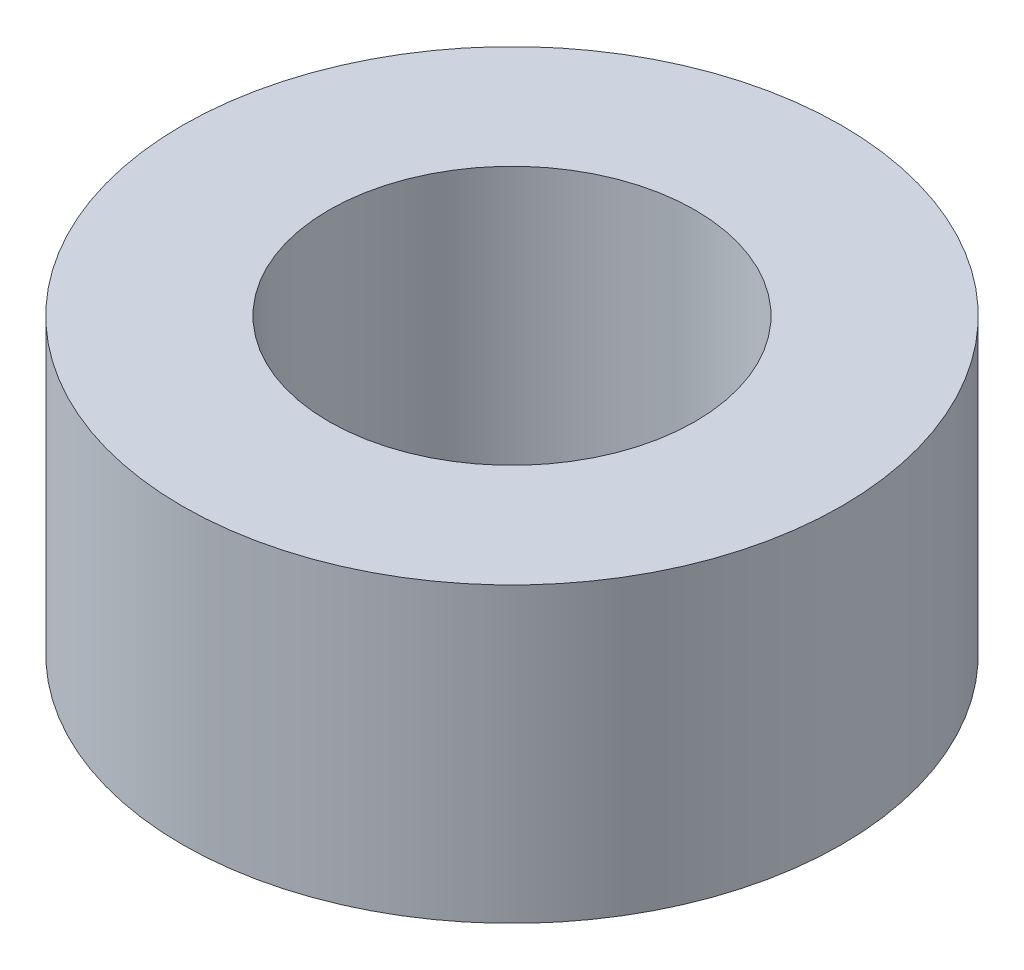
ISO-10303-21;
HEADER;
FILE_DESCRIPTION(('STEP AP214'),'2;1');
FILE_NAME('part.step','',(''),(''),'','','');
FILE_SCHEMA(('AUTOMOTIVE_DESIGN { 1 0 10303 214 1 1 1 1 }'));
ENDSEC;
DATA;
#1=APPLICATION_CONTEXT('core data for automotive mechanical design processes');
#2=APPLICATION_PROTOCOL_DEFINITION('international standard','automotive_design',2000,#1);
#3=PRODUCT_CONTEXT('',#1,'mechanical');
#4=PRODUCT('Part','Part','',(#3));
#5=PRODUCT_RELATED_PRODUCT_CATEGORY('part','',(#4));
#6=PRODUCT_DEFINITION_FORMATION('','',#4);
#7=PRODUCT_DEFINITION_CONTEXT('part definition',#1,'design');
#8=PRODUCT_DEFINITION('design','',#6,#7);
#9=PRODUCT_DEFINITION_SHAPE('','',#8);
#10=(LENGTH_UNIT() NAMED_UNIT(*) SI_UNIT(.MILLI.,.METRE.));
#11=(NAMED_UNIT(*) PLANE_ANGLE_UNIT() SI_UNIT($,.RADIAN.));
#12=(NAMED_UNIT(*) SI_UNIT($,.STERADIAN.) SOLID_ANGLE_UNIT());
#13=UNCERTAINTY_MEASURE_WITH_UNIT(LENGTH_MEASURE(1.E-05),#10,'distance_accuracy_value','');
#14=(GEOMETRIC_REPRESENTATION_CONTEXT(3) GLOBAL_UNCERTAINTY_ASSIGNED_CONTEXT((#13)) GLOBAL_UNIT_ASSIGNED_CONTEXT((#10,
#11,#12)) REPRESENTATION_CONTEXT('',''));
#15=CARTESIAN_POINT('',(0.,0.,0.));
#16=DIRECTION('',(0.,0.,1.));
#17=DIRECTION('',(1.,0.,0.));
#18=AXIS2_PLACEMENT_3D('',#15,#16,#17);
#19=CARTESIAN_POINT('',(0.,6.35,0.));
#20=DIRECTION('',(0.,1.,0.));
#21=DIRECTION('',(0.,0.,1.));
#22=AXIS2_PLACEMENT_3D('',#19,#20,#21);
#23=PLANE('',#22);
#24=CARTESIAN_POINT('',(0.,6.35,0.));
#25=DIRECTION('',(0.,1.,0.));
#26=DIRECTION('',(0.,0.,1.));
#27=AXIS2_PLACEMENT_3D('',#24,#25,#26);
#28=CIRCLE('',#27,7.14375);
#29=CARTESIAN_POINT('',(0.,6.35,7.14375));
#30=VERTEX_POINT('',#29);
#31=EDGE_CURVE('E10',#30,#30,#28,.T.);
#32=ORIENTED_EDGE('',*,*,#31,.T.);
#33=EDGE_LOOP('',(#32));
#34=FACE_BOUND('',#33,.T.);
#35=CARTESIAN_POINT('',(0.,6.35,0.));
#36=DIRECTION('',(0.,1.,0.));
#37=DIRECTION('',(0.,0.,1.));
#38=AXIS2_PLACEMENT_3D('',#35,#36,#37);
#39=CIRCLE('',#38,3.96875);
#40=CARTESIAN_POINT('',(0.,6.35,3.96875));
#41=VERTEX_POINT('',#40);
#42=EDGE_CURVE('E42',#41,#41,#39,.T.);
#43=ORIENTED_EDGE('',*,*,#42,.F.);
#44=EDGE_LOOP('',(#43));
#45=FACE_BOUND('',#44,.T.);
#46=ADVANCED_FACE('F31',(#34,#45),#23,.T.);
#47=CARTESIAN_POINT('',(0.,0.,0.));
#48=DIRECTION('',(0.,1.,0.));
#49=DIRECTION('',(0.,0.,1.));
#50=AXIS2_PLACEMENT_3D('',#47,#48,#49);
#51=PLANE('',#50);
#52=CARTESIAN_POINT('',(0.,0.,0.));
#53=DIRECTION('',(0.,1.,0.));
#54=DIRECTION('',(0.,0.,1.));
#55=AXIS2_PLACEMENT_3D('',#52,#53,#54);
#56=CIRCLE('',#55,7.14375);
#57=CARTESIAN_POINT('',(0.,0.,7.14375));
#58=VERTEX_POINT('',#57);
#59=EDGE_CURVE('E35',#58,#58,#56,.T.);
#60=ORIENTED_EDGE('',*,*,#59,.F.);
#61=EDGE_LOOP('',(#60));
#62=FACE_BOUND('',#61,.T.);
#63=CARTESIAN_POINT('',(0.,0.,0.));
#64=DIRECTION('',(0.,1.,0.));
#65=DIRECTION('',(0.,0.,1.));
#66=AXIS2_PLACEMENT_3D('',#63,#64,#65);
#67=CIRCLE('',#66,3.96875);
#68=CARTESIAN_POINT('',(0.,0.,3.96875));
#69=VERTEX_POINT('',#68);
#70=EDGE_CURVE('E44',#69,#69,#67,.T.);
#71=ORIENTED_EDGE('',*,*,#70,.T.);
#72=EDGE_LOOP('',(#71));
#73=FACE_BOUND('',#72,.T.);
#74=ADVANCED_FACE('F54',(#62,#73),#51,.F.);
#75=CARTESIAN_POINT('',(0.,6.35,0.));
#76=DIRECTION('',(0.,-1.,0.));
#77=DIRECTION('',(0.,0.,-1.));
#78=AXIS2_PLACEMENT_3D('',#75,#76,#77);
#79=CYLINDRICAL_SURFACE('',#78,7.14375);
#80=ORIENTED_EDGE('',*,*,#31,.F.);
#81=EDGE_LOOP('',(#80));
#82=FACE_BOUND('',#81,.T.);
#83=ORIENTED_EDGE('',*,*,#59,.T.);
#84=EDGE_LOOP('',(#83));
#85=FACE_BOUND('',#84,.T.);
#86=ADVANCED_FACE('F33',(#82,#85),#79,.T.);
#87=CARTESIAN_POINT('',(0.,6.35,0.));
#88=DIRECTION('',(0.,-1.,0.));
#89=DIRECTION('',(0.,0.,-1.));
#90=AXIS2_PLACEMENT_3D('',#87,#88,#89);
#91=CYLINDRICAL_SURFACE('',#90,3.96875);
#92=ORIENTED_EDGE('',*,*,#42,.T.);
#93=EDGE_LOOP('',(#92));
#94=FACE_BOUND('',#93,.T.);
#95=ORIENTED_EDGE('',*,*,#70,.F.);
#96=EDGE_LOOP('',(#95));
#97=FACE_BOUND('',#96,.T.);
#98=ADVANCED_FACE('F50',(#94,#97),#91,.F.);
#99=CLOSED_SHELL('',(#46,#74,#86,#98));
#100=MANIFOLD_SOLID_BREP('B2',#99);
#101=ADVANCED_BREP_SHAPE_REPRESENTATION('',(#18,#100),#14);
#102=SHAPE_DEFINITION_REPRESENTATION(#9,#101);
ENDSEC;
END-ISO-10303-21;
